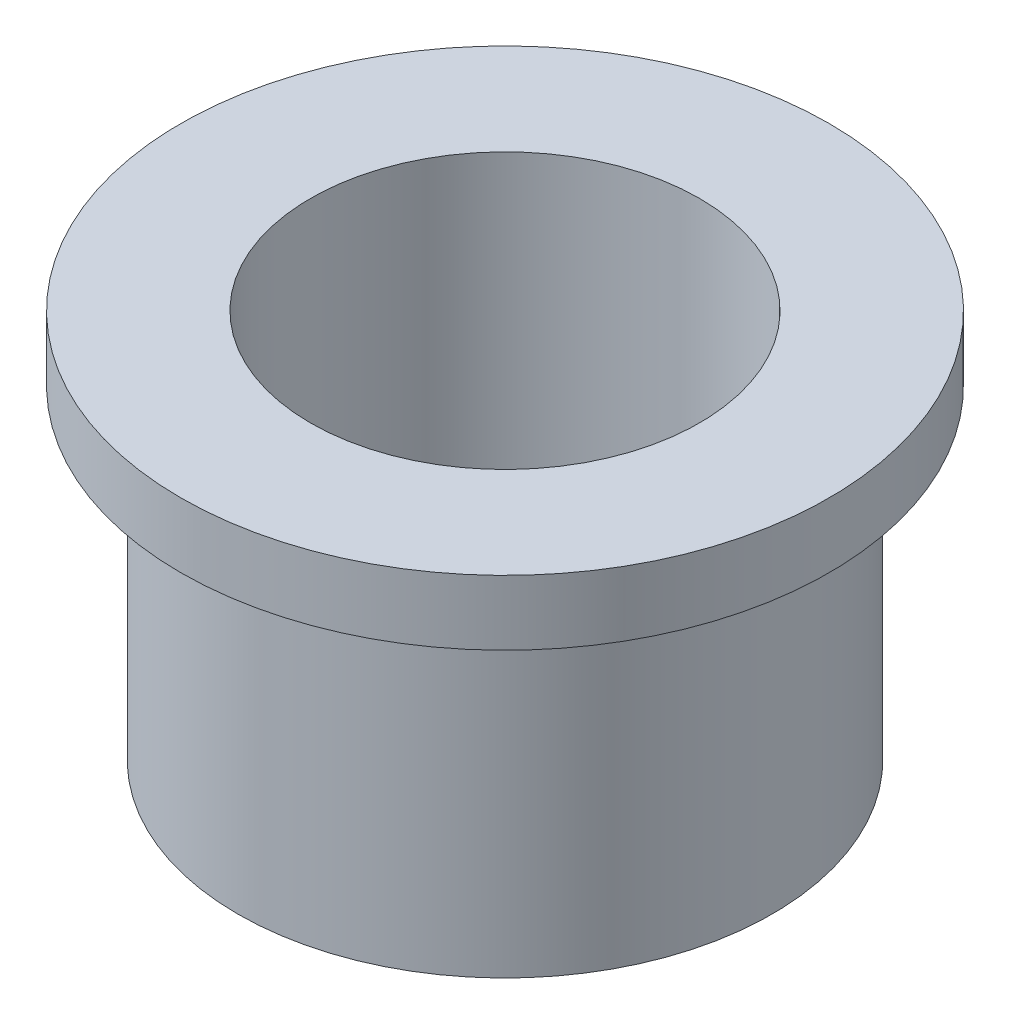
ISO-10303-21;
HEADER;
FILE_DESCRIPTION(('STEP AP214'),'2;1');
FILE_NAME('part.step','',(''),(''),'','','');
FILE_SCHEMA(('AUTOMOTIVE_DESIGN { 1 0 10303 214 1 1 1 1 }'));
ENDSEC;
DATA;
#1=APPLICATION_CONTEXT('core data for automotive mechanical design processes');
#2=APPLICATION_PROTOCOL_DEFINITION('international standard','automotive_design',2000,#1);
#3=PRODUCT_CONTEXT('',#1,'mechanical');
#4=PRODUCT('Part','Part','',(#3));
#5=PRODUCT_RELATED_PRODUCT_CATEGORY('part','',(#4));
#6=PRODUCT_DEFINITION_FORMATION('','',#4);
#7=PRODUCT_DEFINITION_CONTEXT('part definition',#1,'design');
#8=PRODUCT_DEFINITION('design','',#6,#7);
#9=PRODUCT_DEFINITION_SHAPE('','',#8);
#10=(LENGTH_UNIT() NAMED_UNIT(*) SI_UNIT(.MILLI.,.METRE.));
#11=(NAMED_UNIT(*) PLANE_ANGLE_UNIT() SI_UNIT($,.RADIAN.));
#12=(NAMED_UNIT(*) SI_UNIT($,.STERADIAN.) SOLID_ANGLE_UNIT());
#13=UNCERTAINTY_MEASURE_WITH_UNIT(LENGTH_MEASURE(1.E-05),#10,'distance_accuracy_value','');
#14=(GEOMETRIC_REPRESENTATION_CONTEXT(3) GLOBAL_UNCERTAINTY_ASSIGNED_CONTEXT((#13)) GLOBAL_UNIT_ASSIGNED_CONTEXT((#10,
#11,#12)) REPRESENTATION_CONTEXT('',''));
#15=CARTESIAN_POINT('',(0.,0.,0.));
#16=DIRECTION('',(0.,0.,1.));
#17=DIRECTION('',(1.,0.,0.));
#18=AXIS2_PLACEMENT_3D('',#15,#16,#17);
#19=CARTESIAN_POINT('',(0.,0.,0.));
#20=DIRECTION('',(0.,1.,0.));
#21=DIRECTION('',(0.,0.,1.));
#22=AXIS2_PLACEMENT_3D('',#19,#20,#21);
#23=CYLINDRICAL_SURFACE('',#22,19.05);
#24=CARTESIAN_POINT('',(0.,0.,0.));
#25=DIRECTION('',(0.,1.,0.));
#26=DIRECTION('',(0.,0.,1.));
#27=AXIS2_PLACEMENT_3D('',#24,#25,#26);
#28=CIRCLE('',#27,19.05);
#29=CARTESIAN_POINT('',(0.,0.,19.05));
#30=VERTEX_POINT('',#29);
#31=EDGE_CURVE('E55',#30,#30,#28,.T.);
#32=ORIENTED_EDGE('',*,*,#31,.T.);
#33=EDGE_LOOP('',(#32));
#34=FACE_BOUND('',#33,.T.);
#35=CARTESIAN_POINT('',(0.,-38.1,0.));
#36=DIRECTION('',(0.,1.,0.));
#37=DIRECTION('',(0.,0.,1.));
#38=AXIS2_PLACEMENT_3D('',#35,#36,#37);
#39=CIRCLE('',#38,19.05);
#40=CARTESIAN_POINT('',(0.,-38.1,19.05));
#41=VERTEX_POINT('',#40);
#42=EDGE_CURVE('E10',#41,#41,#39,.T.);
#43=ORIENTED_EDGE('',*,*,#42,.F.);
#44=EDGE_LOOP('',(#43));
#45=FACE_BOUND('',#44,.T.);
#46=ADVANCED_FACE('F33',(#34,#45),#23,.F.);
#47=CARTESIAN_POINT('',(0.,-38.1,0.));
#48=DIRECTION('',(0.,-1.,0.));
#49=DIRECTION('',(0.,0.,-1.));
#50=AXIS2_PLACEMENT_3D('',#47,#48,#49);
#51=PLANE('',#50);
#52=ORIENTED_EDGE('',*,*,#42,.T.);
#53=EDGE_LOOP('',(#52));
#54=FACE_BOUND('',#53,.T.);
#55=CARTESIAN_POINT('',(0.,-38.1,0.));
#56=DIRECTION('',(0.,1.,0.));
#57=DIRECTION('',(0.,0.,1.));
#58=AXIS2_PLACEMENT_3D('',#55,#56,#57);
#59=CIRCLE('',#58,26.162);
#60=CARTESIAN_POINT('',(0.,-38.1,26.162));
#61=VERTEX_POINT('',#60);
#62=EDGE_CURVE('E39',#61,#61,#59,.T.);
#63=ORIENTED_EDGE('',*,*,#62,.F.);
#64=EDGE_LOOP('',(#63));
#65=FACE_BOUND('',#64,.T.);
#66=ADVANCED_FACE('F73',(#54,#65),#51,.T.);
#67=CARTESIAN_POINT('',(0.,0.,0.));
#68=DIRECTION('',(0.,1.,0.));
#69=DIRECTION('',(0.,0.,1.));
#70=AXIS2_PLACEMENT_3D('',#67,#68,#69);
#71=CYLINDRICAL_SURFACE('',#70,26.162);
#72=ORIENTED_EDGE('',*,*,#62,.T.);
#73=EDGE_LOOP('',(#72));
#74=FACE_BOUND('',#73,.T.);
#75=CARTESIAN_POINT('',(0.,-6.35,0.));
#76=DIRECTION('',(0.,1.,0.));
#77=DIRECTION('',(0.,0.,1.));
#78=AXIS2_PLACEMENT_3D('',#75,#76,#77);
#79=CIRCLE('',#78,26.162);
#80=CARTESIAN_POINT('',(0.,-6.35,26.162));
#81=VERTEX_POINT('',#80);
#82=EDGE_CURVE('E43',#81,#81,#79,.T.);
#83=ORIENTED_EDGE('',*,*,#82,.F.);
#84=EDGE_LOOP('',(#83));
#85=FACE_BOUND('',#84,.T.);
#86=ADVANCED_FACE('F77',(#74,#85),#71,.T.);
#87=CARTESIAN_POINT('',(0.,-6.35,0.));
#88=DIRECTION('',(0.,-1.,0.));
#89=DIRECTION('',(0.,0.,-1.));
#90=AXIS2_PLACEMENT_3D('',#87,#88,#89);
#91=PLANE('',#90);
#92=ORIENTED_EDGE('',*,*,#82,.T.);
#93=EDGE_LOOP('',(#92));
#94=FACE_BOUND('',#93,.T.);
#95=CARTESIAN_POINT('',(0.,-6.35,0.));
#96=DIRECTION('',(0.,1.,0.));
#97=DIRECTION('',(0.,0.,1.));
#98=AXIS2_PLACEMENT_3D('',#95,#96,#97);
#99=CIRCLE('',#98,31.75);
#100=CARTESIAN_POINT('',(0.,-6.35,31.75));
#101=VERTEX_POINT('',#100);
#102=EDGE_CURVE('E47',#101,#101,#99,.T.);
#103=ORIENTED_EDGE('',*,*,#102,.F.);
#104=EDGE_LOOP('',(#103));
#105=FACE_BOUND('',#104,.T.);
#106=ADVANCED_FACE('F69',(#94,#105),#91,.T.);
#107=CARTESIAN_POINT('',(0.,0.,0.));
#108=DIRECTION('',(0.,1.,0.));
#109=DIRECTION('',(0.,0.,1.));
#110=AXIS2_PLACEMENT_3D('',#107,#108,#109);
#111=CYLINDRICAL_SURFACE('',#110,31.75);
#112=ORIENTED_EDGE('',*,*,#102,.T.);
#113=EDGE_LOOP('',(#112));
#114=FACE_BOUND('',#113,.T.);
#115=CARTESIAN_POINT('',(0.,0.,0.));
#116=DIRECTION('',(0.,1.,0.));
#117=DIRECTION('',(0.,0.,1.));
#118=AXIS2_PLACEMENT_3D('',#115,#116,#117);
#119=CIRCLE('',#118,31.75);
#120=CARTESIAN_POINT('',(0.,0.,31.75));
#121=VERTEX_POINT('',#120);
#122=EDGE_CURVE('E52',#121,#121,#119,.T.);
#123=ORIENTED_EDGE('',*,*,#122,.F.);
#124=EDGE_LOOP('',(#123));
#125=FACE_BOUND('',#124,.T.);
#126=ADVANCED_FACE('F63',(#114,#125),#111,.T.);
#127=CARTESIAN_POINT('',(0.,0.,0.));
#128=DIRECTION('',(0.,1.,0.));
#129=DIRECTION('',(0.,0.,1.));
#130=AXIS2_PLACEMENT_3D('',#127,#128,#129);
#131=PLANE('',#130);
#132=ORIENTED_EDGE('',*,*,#122,.T.);
#133=EDGE_LOOP('',(#132));
#134=FACE_BOUND('',#133,.T.);
#135=ORIENTED_EDGE('',*,*,#31,.F.);
#136=EDGE_LOOP('',(#135));
#137=FACE_BOUND('',#136,.T.);
#138=ADVANCED_FACE('F61',(#134,#137),#131,.T.);
#139=CLOSED_SHELL('',(#46,#66,#86,#106,#126,#138));
#140=MANIFOLD_SOLID_BREP('B2',#139);
#141=ADVANCED_BREP_SHAPE_REPRESENTATION('',(#18,#140),#14);
#142=SHAPE_DEFINITION_REPRESENTATION(#9,#141);
ENDSEC;
END-ISO-10303-21;
